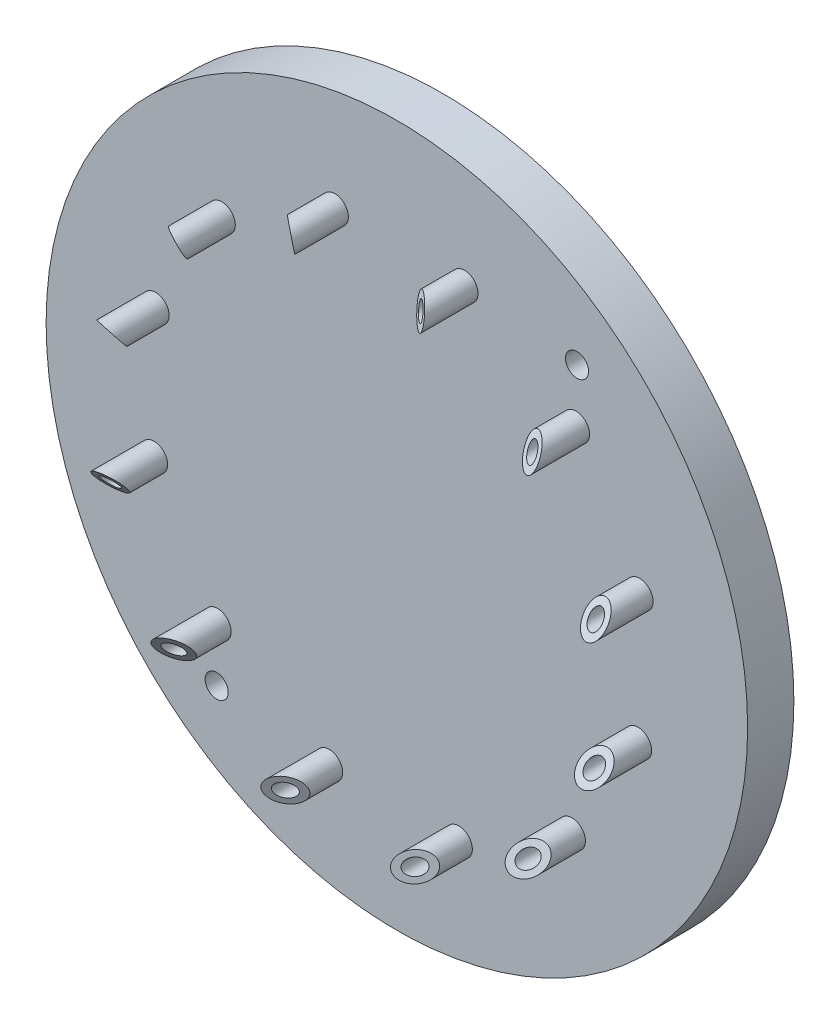
ISO-10303-21;
HEADER;
FILE_DESCRIPTION(('STEP AP214'),'2;1');
FILE_NAME('part.step','',(''),(''),'','','');
FILE_SCHEMA(('AUTOMOTIVE_DESIGN { 1 0 10303 214 1 1 1 1 }'));
ENDSEC;
DATA;
#1=APPLICATION_CONTEXT('core data for automotive mechanical design processes');
#2=APPLICATION_PROTOCOL_DEFINITION('international standard','automotive_design',2000,#1);
#3=PRODUCT_CONTEXT('',#1,'mechanical');
#4=PRODUCT('Part','Part','',(#3));
#5=PRODUCT_RELATED_PRODUCT_CATEGORY('part','',(#4));
#6=PRODUCT_DEFINITION_FORMATION('','',#4);
#7=PRODUCT_DEFINITION_CONTEXT('part definition',#1,'design');
#8=PRODUCT_DEFINITION('design','',#6,#7);
#9=PRODUCT_DEFINITION_SHAPE('','',#8);
#10=(LENGTH_UNIT() NAMED_UNIT(*) SI_UNIT(.MILLI.,.METRE.));
#11=(NAMED_UNIT(*) PLANE_ANGLE_UNIT() SI_UNIT($,.RADIAN.));
#12=(NAMED_UNIT(*) SI_UNIT($,.STERADIAN.) SOLID_ANGLE_UNIT());
#13=UNCERTAINTY_MEASURE_WITH_UNIT(LENGTH_MEASURE(1.E-05),#10,'distance_accuracy_value','');
#14=(GEOMETRIC_REPRESENTATION_CONTEXT(3) GLOBAL_UNCERTAINTY_ASSIGNED_CONTEXT((#13)) GLOBAL_UNIT_ASSIGNED_CONTEXT((#10,
#11,#12)) REPRESENTATION_CONTEXT('',''));
#15=CARTESIAN_POINT('',(0.,0.,0.));
#16=DIRECTION('',(0.,0.,1.));
#17=DIRECTION('',(1.,0.,0.));
#18=AXIS2_PLACEMENT_3D('',#15,#16,#17);
#19=CARTESIAN_POINT('',(-8.04204790409298,31.4892912830421,13.1510056260954));
#20=DIRECTION('',(0.,0.,-1.));
#21=DIRECTION('',(-1.,0.,0.));
#22=AXIS2_PLACEMENT_3D('',#19,#20,#21);
#23=CYLINDRICAL_SURFACE('',#22,1.75000000000003);
#24=CARTESIAN_POINT('',(-8.04204790409298,31.4892912830421,6.));
#25=DIRECTION('',(0.,0.,-1.));
#26=DIRECTION('',(-1.,0.,0.));
#27=AXIS2_PLACEMENT_3D('',#24,#25,#26);
#28=CIRCLE('',#27,1.75000000000003);
#29=CARTESIAN_POINT('',(-9.79204790409301,31.4892912830421,6.));
#30=VERTEX_POINT('',#29);
#31=EDGE_CURVE('E19',#30,#30,#28,.T.);
#32=ORIENTED_EDGE('',*,*,#31,.F.);
#33=EDGE_LOOP('',(#32));
#34=FACE_BOUND('',#33,.T.);
#35=CARTESIAN_POINT('',(-8.04204790409298,31.4892912830421,11.6844891227726));
#36=DIRECTION('',(-0.622322508349962,-0.158934901994472,0.766455734226719));
#37=DIRECTION('',(-0.742619934480711,-0.189657653262092,-0.642297133319915));
#38=AXIS2_PLACEMENT_3D('',#35,#36,#37);
#39=ELLIPSE('',#38,2.28323688094735,1.75000000000003);
#40=CARTESIAN_POINT('',(-9.73762512702605,31.0562579343602,10.2179726194498));
#41=VERTEX_POINT('',#40);
#42=EDGE_CURVE('E153',#41,#41,#39,.T.);
#43=ORIENTED_EDGE('',*,*,#42,.F.);
#44=EDGE_LOOP('',(#43));
#45=FACE_BOUND('',#44,.T.);
#46=ADVANCED_FACE('F15',(#34,#45),#23,.T.);
#47=CARTESIAN_POINT('',(8.78002785812512,31.2915501503289,13.1510056260954));
#48=DIRECTION('',(0.,0.,-1.));
#49=DIRECTION('',(-1.,0.,0.));
#50=AXIS2_PLACEMENT_3D('',#47,#48,#49);
#51=CYLINDRICAL_SURFACE('',#50,1.75000000000004);
#52=CARTESIAN_POINT('',(8.78002785812512,31.2915501503289,6.));
#53=DIRECTION('',(0.,0.,-1.));
#54=DIRECTION('',(-1.,0.,0.));
#55=AXIS2_PLACEMENT_3D('',#52,#53,#54);
#56=CIRCLE('',#55,1.75000000000004);
#57=CARTESIAN_POINT('',(7.03002785812508,31.2915501503289,6.));
#58=VERTEX_POINT('',#57);
#59=EDGE_CURVE('E185',#58,#58,#56,.T.);
#60=ORIENTED_EDGE('',*,*,#59,.F.);
#61=EDGE_LOOP('',(#60));
#62=FACE_BOUND('',#61,.T.);
#63=CARTESIAN_POINT('',(8.78002785812512,31.2915501503289,11.6844891227726));
#64=DIRECTION('',(-0.618414552575162,0.173519591499769,0.766455734226717));
#65=DIRECTION('',(-0.737956555248078,0.20706162149323,-0.642297133319918));
#66=AXIS2_PLACEMENT_3D('',#63,#64,#65);
#67=ELLIPSE('',#66,2.28323688094738,1.75000000000004);
#68=CARTESIAN_POINT('',(7.09509823464583,31.764320881151,10.2179726194498));
#69=VERTEX_POINT('',#68);
#70=EDGE_CURVE('E150',#69,#69,#67,.T.);
#71=ORIENTED_EDGE('',*,*,#70,.F.);
#72=EDGE_LOOP('',(#71));
#73=FACE_BOUND('',#72,.T.);
#74=ADVANCED_FACE('F197',(#62,#73),#51,.T.);
#75=CARTESIAN_POINT('',(23.2495022462359,22.709263424917,13.1510056260954));
#76=DIRECTION('',(0.,0.,-1.));
#77=DIRECTION('',(-1.,0.,0.));
#78=AXIS2_PLACEMENT_3D('',#75,#76,#77);
#79=CYLINDRICAL_SURFACE('',#78,1.75);
#80=CARTESIAN_POINT('',(23.2495022462359,22.709263424917,6.));
#81=DIRECTION('',(0.,0.,-1.));
#82=DIRECTION('',(-1.,0.,0.));
#83=AXIS2_PLACEMENT_3D('',#80,#81,#82);
#84=CIRCLE('',#83,1.75);
#85=CARTESIAN_POINT('',(21.4995022462359,22.709263424917,6.));
#86=VERTEX_POINT('',#85);
#87=EDGE_CURVE('E183',#86,#86,#84,.T.);
#88=ORIENTED_EDGE('',*,*,#87,.F.);
#89=EDGE_LOOP('',(#88));
#90=FACE_BOUND('',#89,.T.);
#91=CARTESIAN_POINT('',(23.2495022462359,22.709263424917,11.6844891227726));
#92=DIRECTION('',(-0.448802916850184,0.459479650580684,0.766455734226719));
#93=DIRECTION('',(-0.535558312987469,0.548298901985984,-0.642297133319915));
#94=AXIS2_PLACEMENT_3D('',#91,#92,#93);
#95=ELLIPSE('',#94,2.28323688094732,1.75);
#96=CARTESIAN_POINT('',(22.026695754125,23.9611596997143,10.2179726194499));
#97=VERTEX_POINT('',#96);
#98=EDGE_CURVE('E147',#97,#97,#95,.T.);
#99=ORIENTED_EDGE('',*,*,#98,.F.);
#100=EDGE_LOOP('',(#99));
#101=FACE_BOUND('',#100,.T.);
#102=ADVANCED_FACE('F337',(#90,#101),#79,.T.);
#103=CARTESIAN_POINT('',(31.4892912830421,8.04204790409298,13.1510056260954));
#104=DIRECTION('',(0.,0.,-1.));
#105=DIRECTION('',(-1.,0.,0.));
#106=AXIS2_PLACEMENT_3D('',#103,#104,#105);
#107=CYLINDRICAL_SURFACE('',#106,1.75000000000003);
#108=CARTESIAN_POINT('',(31.4892912830421,8.04204790409298,6.));
#109=DIRECTION('',(0.,0.,-1.));
#110=DIRECTION('',(-1.,0.,0.));
#111=AXIS2_PLACEMENT_3D('',#108,#109,#110);
#112=CIRCLE('',#111,1.75000000000003);
#113=CARTESIAN_POINT('',(29.7392912830421,8.04204790409298,6.));
#114=VERTEX_POINT('',#113);
#115=EDGE_CURVE('E180',#114,#114,#112,.T.);
#116=ORIENTED_EDGE('',*,*,#115,.F.);
#117=EDGE_LOOP('',(#116));
#118=FACE_BOUND('',#117,.T.);
#119=CARTESIAN_POINT('',(31.4892912830421,8.04204790409298,11.6844891227726));
#120=DIRECTION('',(-0.158934901994472,0.622322508349962,0.766455734226719));
#121=DIRECTION('',(-0.189657653262092,0.742619934480711,-0.642297133319915));
#122=AXIS2_PLACEMENT_3D('',#119,#120,#121);
#123=ELLIPSE('',#122,2.28323688094735,1.75000000000003);
#124=CARTESIAN_POINT('',(31.0562579343602,9.73762512702605,10.2179726194498));
#125=VERTEX_POINT('',#124);
#126=EDGE_CURVE('E144',#125,#125,#123,.T.);
#127=ORIENTED_EDGE('',*,*,#126,.F.);
#128=EDGE_LOOP('',(#127));
#129=FACE_BOUND('',#128,.T.);
#130=ADVANCED_FACE('F339',(#118,#129),#107,.T.);
#131=CARTESIAN_POINT('',(31.2915501503289,-8.78002785812511,13.1510056260954));
#132=DIRECTION('',(0.,0.,-1.));
#133=DIRECTION('',(-1.,0.,0.));
#134=AXIS2_PLACEMENT_3D('',#131,#132,#133);
#135=CYLINDRICAL_SURFACE('',#134,1.75000000000004);
#136=CARTESIAN_POINT('',(31.2915501503289,-8.78002785812511,6.));
#137=DIRECTION('',(0.,0.,-1.));
#138=DIRECTION('',(-1.,0.,0.));
#139=AXIS2_PLACEMENT_3D('',#136,#137,#138);
#140=CIRCLE('',#139,1.75000000000004);
#141=CARTESIAN_POINT('',(29.5415501503289,-8.78002785812511,6.));
#142=VERTEX_POINT('',#141);
#143=EDGE_CURVE('E177',#142,#142,#140,.T.);
#144=ORIENTED_EDGE('',*,*,#143,.F.);
#145=EDGE_LOOP('',(#144));
#146=FACE_BOUND('',#145,.T.);
#147=CARTESIAN_POINT('',(31.2915501503289,-8.78002785812511,11.6844891227726));
#148=DIRECTION('',(0.173519591499772,0.618414552575158,0.76645573422672));
#149=DIRECTION('',(0.207061621493235,0.73795655524808,-0.642297133319915));
#150=AXIS2_PLACEMENT_3D('',#147,#148,#149);
#151=ELLIPSE('',#150,2.28323688094737,1.75000000000004);
#152=CARTESIAN_POINT('',(31.764320881151,-7.09509823464583,10.2179726194498));
#153=VERTEX_POINT('',#152);
#154=EDGE_CURVE('E141',#153,#153,#151,.T.);
#155=ORIENTED_EDGE('',*,*,#154,.F.);
#156=EDGE_LOOP('',(#155));
#157=FACE_BOUND('',#156,.T.);
#158=ADVANCED_FACE('F346',(#146,#157),#135,.T.);
#159=CARTESIAN_POINT('',(22.709263424917,-23.2495022462359,13.1510056260954));
#160=DIRECTION('',(0.,0.,-1.));
#161=DIRECTION('',(-1.,0.,0.));
#162=AXIS2_PLACEMENT_3D('',#159,#160,#161);
#163=CYLINDRICAL_SURFACE('',#162,1.75);
#164=CARTESIAN_POINT('',(22.709263424917,-23.2495022462359,6.));
#165=DIRECTION('',(0.,0.,-1.));
#166=DIRECTION('',(-1.,0.,0.));
#167=AXIS2_PLACEMENT_3D('',#164,#165,#166);
#168=CIRCLE('',#167,1.75);
#169=CARTESIAN_POINT('',(20.959263424917,-23.2495022462359,6.));
#170=VERTEX_POINT('',#169);
#171=EDGE_CURVE('E174',#170,#170,#168,.T.);
#172=ORIENTED_EDGE('',*,*,#171,.F.);
#173=EDGE_LOOP('',(#172));
#174=FACE_BOUND('',#173,.T.);
#175=CARTESIAN_POINT('',(22.709263424917,-23.2495022462359,11.6844891227726));
#176=DIRECTION('',(0.459479650580684,0.448802916850184,0.766455734226719));
#177=DIRECTION('',(0.548298901985984,0.535558312987469,-0.642297133319915));
#178=AXIS2_PLACEMENT_3D('',#175,#176,#177);
#179=ELLIPSE('',#178,2.28323688094732,1.75);
#180=CARTESIAN_POINT('',(23.9611596997143,-22.026695754125,10.2179726194499));
#181=VERTEX_POINT('',#180);
#182=EDGE_CURVE('E138',#181,#181,#179,.T.);
#183=ORIENTED_EDGE('',*,*,#182,.F.);
#184=EDGE_LOOP('',(#183));
#185=FACE_BOUND('',#184,.T.);
#186=ADVANCED_FACE('F355',(#174,#185),#163,.T.);
#187=CARTESIAN_POINT('',(8.04204790409293,-31.4892912830422,13.1510056260953));
#188=DIRECTION('',(0.,0.,-1.));
#189=DIRECTION('',(-1.,0.,0.));
#190=AXIS2_PLACEMENT_3D('',#187,#188,#189);
#191=CYLINDRICAL_SURFACE('',#190,1.74999999999994);
#192=CARTESIAN_POINT('',(8.04204790409293,-31.4892912830422,6.));
#193=DIRECTION('',(0.,0.,-1.));
#194=DIRECTION('',(-1.,0.,0.));
#195=AXIS2_PLACEMENT_3D('',#192,#193,#194);
#196=CIRCLE('',#195,1.74999999999994);
#197=CARTESIAN_POINT('',(6.29204790409299,-31.4892912830422,6.));
#198=VERTEX_POINT('',#197);
#199=EDGE_CURVE('E171',#198,#198,#196,.T.);
#200=ORIENTED_EDGE('',*,*,#199,.F.);
#201=EDGE_LOOP('',(#200));
#202=FACE_BOUND('',#201,.T.);
#203=CARTESIAN_POINT('',(8.04204790409293,-31.4892912830422,11.6844891227727));
#204=DIRECTION('',(0.622322508349963,0.158934901994472,0.766455734226718));
#205=DIRECTION('',(0.74261993448071,0.189657653262092,-0.642297133319916));
#206=AXIS2_PLACEMENT_3D('',#203,#204,#205);
#207=ELLIPSE('',#206,2.28323688094724,1.74999999999994);
#208=CARTESIAN_POINT('',(9.7376251270259,-31.0562579343603,10.21797261945));
#209=VERTEX_POINT('',#208);
#210=EDGE_CURVE('E135',#209,#209,#207,.T.);
#211=ORIENTED_EDGE('',*,*,#210,.F.);
#212=EDGE_LOOP('',(#211));
#213=FACE_BOUND('',#212,.T.);
#214=ADVANCED_FACE('F359',(#202,#213),#191,.T.);
#215=CARTESIAN_POINT('',(-8.78002785812511,-31.2915501503289,13.1510056260954));
#216=DIRECTION('',(0.,0.,-1.));
#217=DIRECTION('',(-1.,0.,0.));
#218=AXIS2_PLACEMENT_3D('',#215,#216,#217);
#219=CYLINDRICAL_SURFACE('',#218,1.75000000000004);
#220=CARTESIAN_POINT('',(-8.78002785812511,-31.2915501503289,6.));
#221=DIRECTION('',(0.,0.,-1.));
#222=DIRECTION('',(-1.,0.,0.));
#223=AXIS2_PLACEMENT_3D('',#220,#221,#222);
#224=CIRCLE('',#223,1.75000000000004);
#225=CARTESIAN_POINT('',(-10.5300278581252,-31.2915501503289,6.));
#226=VERTEX_POINT('',#225);
#227=EDGE_CURVE('E168',#226,#226,#224,.T.);
#228=ORIENTED_EDGE('',*,*,#227,.F.);
#229=EDGE_LOOP('',(#228));
#230=FACE_BOUND('',#229,.T.);
#231=CARTESIAN_POINT('',(-8.78002785812511,-31.2915501503289,11.6844891227726));
#232=DIRECTION('',(0.618414552575158,-0.173519591499772,0.76645573422672));
#233=DIRECTION('',(0.73795655524808,-0.207061621493235,-0.642297133319915));
#234=AXIS2_PLACEMENT_3D('',#231,#232,#233);
#235=ELLIPSE('',#234,2.28323688094737,1.75000000000004);
#236=CARTESIAN_POINT('',(-7.09509823464583,-31.764320881151,10.2179726194498));
#237=VERTEX_POINT('',#236);
#238=EDGE_CURVE('E132',#237,#237,#235,.T.);
#239=ORIENTED_EDGE('',*,*,#238,.F.);
#240=EDGE_LOOP('',(#239));
#241=FACE_BOUND('',#240,.T.);
#242=ADVANCED_FACE('F363',(#230,#241),#219,.T.);
#243=CARTESIAN_POINT('',(-23.2495022462359,-22.709263424917,13.1510056260954));
#244=DIRECTION('',(0.,0.,-1.));
#245=DIRECTION('',(-1.,0.,0.));
#246=AXIS2_PLACEMENT_3D('',#243,#244,#245);
#247=CYLINDRICAL_SURFACE('',#246,1.75);
#248=CARTESIAN_POINT('',(-23.2495022462359,-22.709263424917,6.));
#249=DIRECTION('',(0.,0.,-1.));
#250=DIRECTION('',(-1.,0.,0.));
#251=AXIS2_PLACEMENT_3D('',#248,#249,#250);
#252=CIRCLE('',#251,1.75);
#253=CARTESIAN_POINT('',(-24.9995022462359,-22.709263424917,6.));
#254=VERTEX_POINT('',#253);
#255=EDGE_CURVE('E165',#254,#254,#252,.T.);
#256=ORIENTED_EDGE('',*,*,#255,.F.);
#257=EDGE_LOOP('',(#256));
#258=FACE_BOUND('',#257,.T.);
#259=CARTESIAN_POINT('',(-23.2495022462359,-22.709263424917,11.6844891227726));
#260=DIRECTION('',(0.448802916850184,-0.459479650580684,0.766455734226719));
#261=DIRECTION('',(0.535558312987469,-0.548298901985984,-0.642297133319915));
#262=AXIS2_PLACEMENT_3D('',#259,#260,#261);
#263=ELLIPSE('',#262,2.28323688094732,1.75);
#264=CARTESIAN_POINT('',(-22.026695754125,-23.9611596997143,10.2179726194499));
#265=VERTEX_POINT('',#264);
#266=EDGE_CURVE('E129',#265,#265,#263,.T.);
#267=ORIENTED_EDGE('',*,*,#266,.F.);
#268=EDGE_LOOP('',(#267));
#269=FACE_BOUND('',#268,.T.);
#270=ADVANCED_FACE('F367',(#258,#269),#247,.T.);
#271=CARTESIAN_POINT('',(-31.4892912830421,-8.04204790409299,13.1510056260954));
#272=DIRECTION('',(0.,0.,-1.));
#273=DIRECTION('',(-1.,0.,0.));
#274=AXIS2_PLACEMENT_3D('',#271,#272,#273);
#275=CYLINDRICAL_SURFACE('',#274,1.75000000000003);
#276=CARTESIAN_POINT('',(-31.4892912830421,-8.04204790409299,6.));
#277=DIRECTION('',(0.,0.,-1.));
#278=DIRECTION('',(-1.,0.,0.));
#279=AXIS2_PLACEMENT_3D('',#276,#277,#278);
#280=CIRCLE('',#279,1.75000000000003);
#281=CARTESIAN_POINT('',(-33.2392912830421,-8.04204790409299,6.));
#282=VERTEX_POINT('',#281);
#283=EDGE_CURVE('E162',#282,#282,#280,.T.);
#284=ORIENTED_EDGE('',*,*,#283,.F.);
#285=EDGE_LOOP('',(#284));
#286=FACE_BOUND('',#285,.T.);
#287=CARTESIAN_POINT('',(-31.4892912830421,-8.04204790409299,11.6844891227726));
#288=DIRECTION('',(0.158934901994472,-0.622322508349964,0.766455734226717));
#289=DIRECTION('',(0.189657653262092,-0.742619934480709,-0.642297133319917));
#290=AXIS2_PLACEMENT_3D('',#287,#288,#289);
#291=ELLIPSE('',#290,2.28323688094736,1.75000000000003);
#292=CARTESIAN_POINT('',(-31.0562579343602,-9.73762512702606,10.2179726194498));
#293=VERTEX_POINT('',#292);
#294=EDGE_CURVE('E126',#293,#293,#291,.T.);
#295=ORIENTED_EDGE('',*,*,#294,.F.);
#296=EDGE_LOOP('',(#295));
#297=FACE_BOUND('',#296,.T.);
#298=ADVANCED_FACE('F371',(#286,#297),#275,.T.);
#299=CARTESIAN_POINT('',(-31.2915501503289,8.78002785812511,13.1510056260954));
#300=DIRECTION('',(0.,0.,-1.));
#301=DIRECTION('',(-1.,0.,0.));
#302=AXIS2_PLACEMENT_3D('',#299,#300,#301);
#303=CYLINDRICAL_SURFACE('',#302,1.75000000000004);
#304=CARTESIAN_POINT('',(-31.2915501503289,8.78002785812511,6.));
#305=DIRECTION('',(0.,0.,-1.));
#306=DIRECTION('',(-1.,0.,0.));
#307=AXIS2_PLACEMENT_3D('',#304,#305,#306);
#308=CIRCLE('',#307,1.75000000000004);
#309=CARTESIAN_POINT('',(-33.041550150329,8.78002785812511,6.));
#310=VERTEX_POINT('',#309);
#311=EDGE_CURVE('E159',#310,#310,#308,.T.);
#312=ORIENTED_EDGE('',*,*,#311,.F.);
#313=EDGE_LOOP('',(#312));
#314=FACE_BOUND('',#313,.T.);
#315=CARTESIAN_POINT('',(-31.2915501503289,8.78002785812511,11.6844891227726));
#316=DIRECTION('',(-0.173519591499773,-0.618414552575155,0.766455734226722));
#317=DIRECTION('',(-0.207061621493238,-0.737956555248081,-0.642297133319912));
#318=AXIS2_PLACEMENT_3D('',#315,#316,#317);
#319=ELLIPSE('',#318,2.28323688094736,1.75000000000004);
#320=CARTESIAN_POINT('',(-31.764320881151,7.09509823464582,10.2179726194498));
#321=VERTEX_POINT('',#320);
#322=EDGE_CURVE('E123',#321,#321,#319,.T.);
#323=ORIENTED_EDGE('',*,*,#322,.F.);
#324=EDGE_LOOP('',(#323));
#325=FACE_BOUND('',#324,.T.);
#326=ADVANCED_FACE('F375',(#314,#325),#303,.T.);
#327=CARTESIAN_POINT('',(-22.709263424917,23.2495022462359,13.1510056260954));
#328=DIRECTION('',(0.,0.,-1.));
#329=DIRECTION('',(-1.,0.,0.));
#330=AXIS2_PLACEMENT_3D('',#327,#328,#329);
#331=CYLINDRICAL_SURFACE('',#330,1.75);
#332=CARTESIAN_POINT('',(-22.709263424917,23.2495022462359,6.));
#333=DIRECTION('',(0.,0.,-1.));
#334=DIRECTION('',(-1.,0.,0.));
#335=AXIS2_PLACEMENT_3D('',#332,#333,#334);
#336=CIRCLE('',#335,1.75);
#337=CARTESIAN_POINT('',(-24.459263424917,23.2495022462359,6.));
#338=VERTEX_POINT('',#337);
#339=EDGE_CURVE('E156',#338,#338,#336,.T.);
#340=ORIENTED_EDGE('',*,*,#339,.F.);
#341=EDGE_LOOP('',(#340));
#342=FACE_BOUND('',#341,.T.);
#343=CARTESIAN_POINT('',(-22.709263424917,23.2495022462359,11.6844891227726));
#344=DIRECTION('',(-0.459479650580684,-0.448802916850184,0.766455734226719));
#345=DIRECTION('',(-0.548298901985984,-0.535558312987469,-0.642297133319915));
#346=AXIS2_PLACEMENT_3D('',#343,#344,#345);
#347=ELLIPSE('',#346,2.28323688094732,1.75);
#348=CARTESIAN_POINT('',(-23.9611596997143,22.026695754125,10.2179726194499));
#349=VERTEX_POINT('',#348);
#350=EDGE_CURVE('E120',#349,#349,#347,.T.);
#351=ORIENTED_EDGE('',*,*,#350,.F.);
#352=EDGE_LOOP('',(#351));
#353=FACE_BOUND('',#352,.T.);
#354=ADVANCED_FACE('F214',(#342,#353),#331,.T.);
#355=CARTESIAN_POINT('',(-46.41,-46.41,6.));
#356=DIRECTION('',(0.,0.,1.));
#357=DIRECTION('',(1.,0.,0.));
#358=AXIS2_PLACEMENT_3D('',#355,#356,#357);
#359=PLANE('',#358);
#360=ORIENTED_EDGE('',*,*,#339,.T.);
#361=EDGE_LOOP('',(#360));
#362=FACE_BOUND('',#361,.T.);
#363=ORIENTED_EDGE('',*,*,#311,.T.);
#364=EDGE_LOOP('',(#363));
#365=FACE_BOUND('',#364,.T.);
#366=ORIENTED_EDGE('',*,*,#283,.T.);
#367=EDGE_LOOP('',(#366));
#368=FACE_BOUND('',#367,.T.);
#369=ORIENTED_EDGE('',*,*,#255,.T.);
#370=EDGE_LOOP('',(#369));
#371=FACE_BOUND('',#370,.T.);
#372=ORIENTED_EDGE('',*,*,#227,.T.);
#373=EDGE_LOOP('',(#372));
#374=FACE_BOUND('',#373,.T.);
#375=ORIENTED_EDGE('',*,*,#199,.T.);
#376=EDGE_LOOP('',(#375));
#377=FACE_BOUND('',#376,.T.);
#378=ORIENTED_EDGE('',*,*,#171,.T.);
#379=EDGE_LOOP('',(#378));
#380=FACE_BOUND('',#379,.T.);
#381=ORIENTED_EDGE('',*,*,#143,.T.);
#382=EDGE_LOOP('',(#381));
#383=FACE_BOUND('',#382,.T.);
#384=ORIENTED_EDGE('',*,*,#115,.T.);
#385=EDGE_LOOP('',(#384));
#386=FACE_BOUND('',#385,.T.);
#387=ORIENTED_EDGE('',*,*,#87,.T.);
#388=EDGE_LOOP('',(#387));
#389=FACE_BOUND('',#388,.T.);
#390=ORIENTED_EDGE('',*,*,#59,.T.);
#391=EDGE_LOOP('',(#390));
#392=FACE_BOUND('',#391,.T.);
#393=ORIENTED_EDGE('',*,*,#31,.T.);
#394=EDGE_LOOP('',(#393));
#395=FACE_BOUND('',#394,.T.);
#396=CARTESIAN_POINT('',(-23.3709149745766,-29.709263424917,6.));
#397=DIRECTION('',(0.,0.,-1.));
#398=DIRECTION('',(-1.,0.,0.));
#399=AXIS2_PLACEMENT_3D('',#396,#397,#398);
#400=CIRCLE('',#399,1.5);
#401=CARTESIAN_POINT('',(-24.8709149745766,-29.709263424917,6.));
#402=VERTEX_POINT('',#401);
#403=EDGE_CURVE('E111',#402,#402,#400,.F.);
#404=ORIENTED_EDGE('',*,*,#403,.F.);
#405=EDGE_LOOP('',(#404));
#406=FACE_BOUND('',#405,.T.);
#407=CARTESIAN_POINT('',(23.3709149745766,29.709263424917,6.));
#408=DIRECTION('',(0.,0.,-1.));
#409=DIRECTION('',(-1.,0.,0.));
#410=AXIS2_PLACEMENT_3D('',#407,#408,#409);
#411=CIRCLE('',#410,1.5);
#412=CARTESIAN_POINT('',(21.8709149745766,29.709263424917,6.));
#413=VERTEX_POINT('',#412);
#414=EDGE_CURVE('E114',#413,#413,#411,.F.);
#415=ORIENTED_EDGE('',*,*,#414,.F.);
#416=EDGE_LOOP('',(#415));
#417=FACE_BOUND('',#416,.T.);
#418=CARTESIAN_POINT('',(0.,0.,6.));
#419=DIRECTION('',(0.,0.,-1.));
#420=DIRECTION('',(-1.,0.,0.));
#421=AXIS2_PLACEMENT_3D('',#418,#419,#420);
#422=CIRCLE('',#421,45.5);
#423=CARTESIAN_POINT('',(-45.5,0.,6.));
#424=VERTEX_POINT('',#423);
#425=EDGE_CURVE('E117',#424,#424,#422,.T.);
#426=ORIENTED_EDGE('',*,*,#425,.F.);
#427=EDGE_LOOP('',(#426));
#428=FACE_BOUND('',#427,.T.);
#429=ADVANCED_FACE('F192',(#362,#365,#368,#371,#374,#377,#380,#383,#386,#389,#392,#395,#406,
#417,#428),#359,.T.);
#430=CARTESIAN_POINT('',(-6.78816469681549,33.6518133991158,13.1510056260954));
#431=DIRECTION('',(-0.622322508349962,-0.158934901994472,0.766455734226719));
#432=DIRECTION('',(-0.742619934480713,-0.189657653262083,-0.642297133319915));
#433=AXIS2_PLACEMENT_3D('',#430,#431,#432);
#434=PLANE('',#433);
#435=CARTESIAN_POINT('',(-8.04204790409298,31.4892912830421,11.6844891227726));
#436=DIRECTION('',(-0.622322508349962,-0.158934901994472,0.766455734226719));
#437=DIRECTION('',(-0.74261993448071,-0.189657653262096,-0.642297133319915));
#438=AXIS2_PLACEMENT_3D('',#435,#436,#437);
#439=ELLIPSE('',#438,1.30470678911276,1.);
#440=CARTESIAN_POINT('',(-9.01094917434043,31.2418436552239,10.8464796923025));
#441=VERTEX_POINT('',#440);
#442=EDGE_CURVE('E108',#441,#441,#439,.T.);
#443=ORIENTED_EDGE('',*,*,#442,.F.);
#444=EDGE_LOOP('',(#443));
#445=FACE_BOUND('',#444,.T.);
#446=ORIENTED_EDGE('',*,*,#42,.T.);
#447=EDGE_LOOP('',(#446));
#448=FACE_BOUND('',#447,.T.);
#449=ADVANCED_FACE('F201',(#445,#448),#434,.T.);
#450=CARTESIAN_POINT('',(10.9471836270429,32.5374076354556,13.1510056260954));
#451=DIRECTION('',(-0.618414552575162,0.173519591499769,0.766455734226717));
#452=DIRECTION('',(-0.737956555248077,0.207061621493233,-0.642297133319918));
#453=AXIS2_PLACEMENT_3D('',#450,#451,#452);
#454=PLANE('',#453);
#455=CARTESIAN_POINT('',(8.78002785812517,31.2915501503289,11.6844891227726));
#456=DIRECTION('',(-0.618414552575162,0.173519591499769,0.766455734226717));
#457=DIRECTION('',(-0.737956555248079,0.207061621493227,-0.642297133319918));
#458=AXIS2_PLACEMENT_3D('',#455,#456,#457);
#459=ELLIPSE('',#458,1.30470678911275,0.999999999999997);
#460=CARTESIAN_POINT('',(7.81721093042274,31.5617048536558,10.8464796923025));
#461=VERTEX_POINT('',#460);
#462=EDGE_CURVE('E105',#461,#461,#459,.T.);
#463=ORIENTED_EDGE('',*,*,#462,.F.);
#464=EDGE_LOOP('',(#463));
#465=FACE_BOUND('',#464,.T.);
#466=ORIENTED_EDGE('',*,*,#70,.T.);
#467=EDGE_LOOP('',(#466));
#468=FACE_BOUND('',#467,.T.);
#469=ADVANCED_FACE('F203',(#465,#468),#454,.T.);
#470=CARTESIAN_POINT('',(25.74924293864,22.7046297720728,13.1510056260954));
#471=DIRECTION('',(-0.448802916850184,0.459479650580684,0.766455734226719));
#472=DIRECTION('',(-0.53555831298747,0.548298901985983,-0.642297133319915));
#473=AXIS2_PLACEMENT_3D('',#470,#471,#472);
#474=PLANE('',#473);
#475=CARTESIAN_POINT('',(23.2495022462359,22.709263424917,11.6844891227726));
#476=DIRECTION('',(-0.448802916850184,0.459479650580684,0.766455734226719));
#477=DIRECTION('',(-0.535558312987472,0.548298901985982,-0.642297133319915));
#478=AXIS2_PLACEMENT_3D('',#475,#476,#477);
#479=ELLIPSE('',#478,1.30470678911275,0.999999999999998);
#480=CARTESIAN_POINT('',(22.5507556793154,23.4246327248012,10.8464796923025));
#481=VERTEX_POINT('',#480);
#482=EDGE_CURVE('E102',#481,#481,#479,.T.);
#483=ORIENTED_EDGE('',*,*,#482,.F.);
#484=EDGE_LOOP('',(#483));
#485=FACE_BOUND('',#484,.T.);
#486=ORIENTED_EDGE('',*,*,#98,.T.);
#487=EDGE_LOOP('',(#486));
#488=FACE_BOUND('',#487,.T.);
#489=ADVANCED_FACE('F211',(#485,#488),#474,.T.);
#490=CARTESIAN_POINT('',(33.6518133991158,6.78816469681549,13.1510056260954));
#491=DIRECTION('',(-0.158934901994472,0.622322508349962,0.766455734226719));
#492=DIRECTION('',(-0.189657653262083,0.742619934480713,-0.642297133319915));
#493=AXIS2_PLACEMENT_3D('',#490,#491,#492);
#494=PLANE('',#493);
#495=CARTESIAN_POINT('',(31.4892912830421,8.04204790409298,11.6844891227726));
#496=DIRECTION('',(-0.158934901994472,0.622322508349962,0.766455734226719));
#497=DIRECTION('',(-0.189657653262096,0.74261993448071,-0.642297133319915));
#498=AXIS2_PLACEMENT_3D('',#495,#496,#497);
#499=ELLIPSE('',#498,1.30470678911276,1.);
#500=CARTESIAN_POINT('',(31.2418436552239,9.01094917434043,10.8464796923025));
#501=VERTEX_POINT('',#500);
#502=EDGE_CURVE('E99',#501,#501,#499,.T.);
#503=ORIENTED_EDGE('',*,*,#502,.F.);
#504=EDGE_LOOP('',(#503));
#505=FACE_BOUND('',#504,.T.);
#506=ORIENTED_EDGE('',*,*,#126,.T.);
#507=EDGE_LOOP('',(#506));
#508=FACE_BOUND('',#507,.T.);
#509=ADVANCED_FACE('F324',(#505,#508),#494,.T.);
#510=CARTESIAN_POINT('',(32.5374076354556,-10.9471836270429,13.1510056260954));
#511=DIRECTION('',(0.173519591499772,0.618414552575158,0.76645573422672));
#512=DIRECTION('',(0.207061621493232,0.73795655524808,-0.642297133319915));
#513=AXIS2_PLACEMENT_3D('',#510,#511,#512);
#514=PLANE('',#513);
#515=CARTESIAN_POINT('',(31.2915501503289,-8.78002785812515,11.6844891227726));
#516=DIRECTION('',(0.173519591499772,0.618414552575158,0.76645573422672));
#517=DIRECTION('',(0.207061621493231,0.737956555248081,-0.642297133319915));
#518=AXIS2_PLACEMENT_3D('',#515,#516,#517);
#519=ELLIPSE('',#518,1.30470678911275,0.999999999999997);
#520=CARTESIAN_POINT('',(31.5617048536558,-7.81721093042272,10.8464796923025));
#521=VERTEX_POINT('',#520);
#522=EDGE_CURVE('E96',#521,#521,#519,.T.);
#523=ORIENTED_EDGE('',*,*,#522,.F.);
#524=EDGE_LOOP('',(#523));
#525=FACE_BOUND('',#524,.T.);
#526=ORIENTED_EDGE('',*,*,#154,.T.);
#527=EDGE_LOOP('',(#526));
#528=FACE_BOUND('',#527,.T.);
#529=ADVANCED_FACE('F320',(#525,#528),#514,.T.);
#530=CARTESIAN_POINT('',(22.7046297720728,-25.74924293864,13.1510056260954));
#531=DIRECTION('',(0.459479650580684,0.448802916850184,0.766455734226719));
#532=DIRECTION('',(0.548298901985983,0.53555831298747,-0.642297133319915));
#533=AXIS2_PLACEMENT_3D('',#530,#531,#532);
#534=PLANE('',#533);
#535=CARTESIAN_POINT('',(22.709263424917,-23.2495022462359,11.6844891227726));
#536=DIRECTION('',(0.459479650580684,0.448802916850184,0.766455734226719));
#537=DIRECTION('',(0.548298901985982,0.535558312987472,-0.642297133319915));
#538=AXIS2_PLACEMENT_3D('',#535,#536,#537);
#539=ELLIPSE('',#538,1.30470678911275,0.999999999999998);
#540=CARTESIAN_POINT('',(23.4246327248012,-22.5507556793154,10.8464796923025));
#541=VERTEX_POINT('',#540);
#542=EDGE_CURVE('E93',#541,#541,#539,.T.);
#543=ORIENTED_EDGE('',*,*,#542,.F.);
#544=EDGE_LOOP('',(#543));
#545=FACE_BOUND('',#544,.T.);
#546=ORIENTED_EDGE('',*,*,#182,.T.);
#547=EDGE_LOOP('',(#546));
#548=FACE_BOUND('',#547,.T.);
#549=ADVANCED_FACE('F316',(#545,#548),#534,.T.);
#550=CARTESIAN_POINT('',(6.7881646968155,-33.6518133991158,13.1510056260954));
#551=DIRECTION('',(0.622322508349963,0.158934901994472,0.766455734226718));
#552=DIRECTION('',(0.742619934480712,0.189657653262084,-0.642297133319916));
#553=AXIS2_PLACEMENT_3D('',#550,#551,#552);
#554=PLANE('',#553);
#555=CARTESIAN_POINT('',(8.04204790409296,-31.4892912830422,11.6844891227726));
#556=DIRECTION('',(0.622322508349963,0.158934901994472,0.766455734226718));
#557=DIRECTION('',(0.742619934480709,0.189657653262096,-0.642297133319916));
#558=AXIS2_PLACEMENT_3D('',#555,#556,#557);
#559=ELLIPSE('',#558,1.30470678911275,0.999999999999994);
#560=CARTESIAN_POINT('',(9.0109491743404,-31.2418436552239,10.8464796923025));
#561=VERTEX_POINT('',#560);
#562=EDGE_CURVE('E90',#561,#561,#559,.T.);
#563=ORIENTED_EDGE('',*,*,#562,.F.);
#564=EDGE_LOOP('',(#563));
#565=FACE_BOUND('',#564,.T.);
#566=ORIENTED_EDGE('',*,*,#210,.T.);
#567=EDGE_LOOP('',(#566));
#568=FACE_BOUND('',#567,.T.);
#569=ADVANCED_FACE('F312',(#565,#568),#554,.T.);
#570=CARTESIAN_POINT('',(-10.9471836270429,-32.5374076354556,13.1510056260954));
#571=DIRECTION('',(0.618414552575158,-0.173519591499772,0.76645573422672));
#572=DIRECTION('',(0.73795655524808,-0.207061621493232,-0.642297133319915));
#573=AXIS2_PLACEMENT_3D('',#570,#571,#572);
#574=PLANE('',#573);
#575=CARTESIAN_POINT('',(-8.78002785812515,-31.2915501503289,11.6844891227726));
#576=DIRECTION('',(0.618414552575158,-0.173519591499772,0.76645573422672));
#577=DIRECTION('',(0.737956555248081,-0.207061621493231,-0.642297133319915));
#578=AXIS2_PLACEMENT_3D('',#575,#576,#577);
#579=ELLIPSE('',#578,1.30470678911275,0.999999999999997);
#580=CARTESIAN_POINT('',(-7.81721093042272,-31.5617048536558,10.8464796923025));
#581=VERTEX_POINT('',#580);
#582=EDGE_CURVE('E87',#581,#581,#579,.T.);
#583=ORIENTED_EDGE('',*,*,#582,.F.);
#584=EDGE_LOOP('',(#583));
#585=FACE_BOUND('',#584,.T.);
#586=ORIENTED_EDGE('',*,*,#238,.T.);
#587=EDGE_LOOP('',(#586));
#588=FACE_BOUND('',#587,.T.);
#589=ADVANCED_FACE('F308',(#585,#588),#574,.T.);
#590=CARTESIAN_POINT('',(-25.74924293864,-22.7046297720728,13.1510056260954));
#591=DIRECTION('',(0.448802916850184,-0.459479650580684,0.766455734226719));
#592=DIRECTION('',(0.53555831298747,-0.548298901985983,-0.642297133319915));
#593=AXIS2_PLACEMENT_3D('',#590,#591,#592);
#594=PLANE('',#593);
#595=CARTESIAN_POINT('',(-23.2495022462359,-22.709263424917,11.6844891227726));
#596=DIRECTION('',(0.448802916850184,-0.459479650580684,0.766455734226719));
#597=DIRECTION('',(0.535558312987472,-0.548298901985982,-0.642297133319915));
#598=AXIS2_PLACEMENT_3D('',#595,#596,#597);
#599=ELLIPSE('',#598,1.30470678911275,0.999999999999998);
#600=CARTESIAN_POINT('',(-22.5507556793154,-23.4246327248012,10.8464796923025));
#601=VERTEX_POINT('',#600);
#602=EDGE_CURVE('E84',#601,#601,#599,.T.);
#603=ORIENTED_EDGE('',*,*,#602,.F.);
#604=EDGE_LOOP('',(#603));
#605=FACE_BOUND('',#604,.T.);
#606=ORIENTED_EDGE('',*,*,#266,.T.);
#607=EDGE_LOOP('',(#606));
#608=FACE_BOUND('',#607,.T.);
#609=ADVANCED_FACE('F304',(#605,#608),#594,.T.);
#610=CARTESIAN_POINT('',(-33.6518133991158,-6.78816469681551,13.1510056260954));
#611=DIRECTION('',(0.158934901994472,-0.622322508349964,0.766455734226717));
#612=DIRECTION('',(0.189657653262084,-0.742619934480711,-0.642297133319917));
#613=AXIS2_PLACEMENT_3D('',#610,#611,#612);
#614=PLANE('',#613);
#615=CARTESIAN_POINT('',(-31.4892912830421,-8.04204790409299,11.6844891227726));
#616=DIRECTION('',(0.158934901994472,-0.622322508349964,0.766455734226717));
#617=DIRECTION('',(0.189657653262096,-0.742619934480708,-0.642297133319917));
#618=AXIS2_PLACEMENT_3D('',#615,#616,#617);
#619=ELLIPSE('',#618,1.30470678911276,1.);
#620=CARTESIAN_POINT('',(-31.2418436552239,-9.01094917434044,10.8464796923025));
#621=VERTEX_POINT('',#620);
#622=EDGE_CURVE('E81',#621,#621,#619,.T.);
#623=ORIENTED_EDGE('',*,*,#622,.F.);
#624=EDGE_LOOP('',(#623));
#625=FACE_BOUND('',#624,.T.);
#626=ORIENTED_EDGE('',*,*,#294,.T.);
#627=EDGE_LOOP('',(#626));
#628=FACE_BOUND('',#627,.T.);
#629=ADVANCED_FACE('F300',(#625,#628),#614,.T.);
#630=CARTESIAN_POINT('',(-32.5374076354556,10.9471836270429,13.1510056260954));
#631=DIRECTION('',(-0.173519591499773,-0.618414552575155,0.766455734226722));
#632=DIRECTION('',(-0.207061621493254,-0.737956555248077,-0.642297133319912));
#633=AXIS2_PLACEMENT_3D('',#630,#631,#632);
#634=PLANE('',#633);
#635=CARTESIAN_POINT('',(-31.2915501503289,8.78002785812514,11.6844891227726));
#636=DIRECTION('',(-0.173519591499773,-0.618414552575155,0.766455734226722));
#637=DIRECTION('',(-0.207061621493234,-0.737956555248082,-0.642297133319912));
#638=AXIS2_PLACEMENT_3D('',#635,#636,#637);
#639=ELLIPSE('',#638,1.30470678911274,0.999999999999996);
#640=CARTESIAN_POINT('',(-31.5617048536558,7.81721093042271,10.8464796923025));
#641=VERTEX_POINT('',#640);
#642=EDGE_CURVE('E78',#641,#641,#639,.T.);
#643=ORIENTED_EDGE('',*,*,#642,.F.);
#644=EDGE_LOOP('',(#643));
#645=FACE_BOUND('',#644,.T.);
#646=ORIENTED_EDGE('',*,*,#322,.T.);
#647=EDGE_LOOP('',(#646));
#648=FACE_BOUND('',#647,.T.);
#649=ADVANCED_FACE('F296',(#645,#648),#634,.T.);
#650=CARTESIAN_POINT('',(-22.7046297720728,25.74924293864,13.1510056260954));
#651=DIRECTION('',(-0.459479650580684,-0.448802916850184,0.766455734226719));
#652=DIRECTION('',(-0.548298901985983,-0.53555831298747,-0.642297133319915));
#653=AXIS2_PLACEMENT_3D('',#650,#651,#652);
#654=PLANE('',#653);
#655=CARTESIAN_POINT('',(-22.709263424917,23.2495022462359,11.6844891227726));
#656=DIRECTION('',(-0.459479650580684,-0.448802916850184,0.766455734226719));
#657=DIRECTION('',(-0.548298901985982,-0.535558312987472,-0.642297133319915));
#658=AXIS2_PLACEMENT_3D('',#655,#656,#657);
#659=ELLIPSE('',#658,1.30470678911275,0.999999999999998);
#660=CARTESIAN_POINT('',(-23.4246327248012,22.5507556793154,10.8464796923025));
#661=VERTEX_POINT('',#660);
#662=EDGE_CURVE('E75',#661,#661,#659,.T.);
#663=ORIENTED_EDGE('',*,*,#662,.F.);
#664=EDGE_LOOP('',(#663));
#665=FACE_BOUND('',#664,.T.);
#666=ORIENTED_EDGE('',*,*,#350,.T.);
#667=EDGE_LOOP('',(#666));
#668=FACE_BOUND('',#667,.T.);
#669=ADVANCED_FACE('F292',(#665,#668),#654,.T.);
#670=CARTESIAN_POINT('',(0.,0.,6.));
#671=DIRECTION('',(0.,0.,-1.));
#672=DIRECTION('',(-1.,0.,0.));
#673=AXIS2_PLACEMENT_3D('',#670,#671,#672);
#674=CYLINDRICAL_SURFACE('',#673,45.5);
#675=CARTESIAN_POINT('',(0.,0.,0.));
#676=DIRECTION('',(0.,0.,-1.));
#677=DIRECTION('',(-1.,0.,0.));
#678=AXIS2_PLACEMENT_3D('',#675,#676,#677);
#679=CIRCLE('',#678,45.5);
#680=CARTESIAN_POINT('',(-45.5,0.,0.));
#681=VERTEX_POINT('',#680);
#682=EDGE_CURVE('E72',#681,#681,#679,.T.);
#683=ORIENTED_EDGE('',*,*,#682,.F.);
#684=EDGE_LOOP('',(#683));
#685=FACE_BOUND('',#684,.T.);
#686=ORIENTED_EDGE('',*,*,#425,.T.);
#687=EDGE_LOOP('',(#686));
#688=FACE_BOUND('',#687,.T.);
#689=ADVANCED_FACE('F288',(#685,#688),#674,.T.);
#690=CARTESIAN_POINT('',(23.3709149745766,29.709263424917,6.));
#691=DIRECTION('',(0.,0.,-1.));
#692=DIRECTION('',(-1.,0.,0.));
#693=AXIS2_PLACEMENT_3D('',#690,#691,#692);
#694=CYLINDRICAL_SURFACE('',#693,1.5);
#695=CARTESIAN_POINT('',(23.3709149745766,29.709263424917,0.));
#696=DIRECTION('',(0.,0.,-1.));
#697=DIRECTION('',(-1.,0.,0.));
#698=AXIS2_PLACEMENT_3D('',#695,#696,#697);
#699=CIRCLE('',#698,1.5);
#700=CARTESIAN_POINT('',(21.8709149745766,29.709263424917,0.));
#701=VERTEX_POINT('',#700);
#702=EDGE_CURVE('E69',#701,#701,#699,.F.);
#703=ORIENTED_EDGE('',*,*,#702,.F.);
#704=EDGE_LOOP('',(#703));
#705=FACE_BOUND('',#704,.T.);
#706=ORIENTED_EDGE('',*,*,#414,.T.);
#707=EDGE_LOOP('',(#706));
#708=FACE_BOUND('',#707,.T.);
#709=ADVANCED_FACE('F284',(#705,#708),#694,.F.);
#710=CARTESIAN_POINT('',(-23.3709149745766,-29.709263424917,6.));
#711=DIRECTION('',(0.,0.,-1.));
#712=DIRECTION('',(-1.,0.,0.));
#713=AXIS2_PLACEMENT_3D('',#710,#711,#712);
#714=CYLINDRICAL_SURFACE('',#713,1.5);
#715=CARTESIAN_POINT('',(-23.3709149745766,-29.709263424917,0.));
#716=DIRECTION('',(0.,0.,-1.));
#717=DIRECTION('',(-1.,0.,0.));
#718=AXIS2_PLACEMENT_3D('',#715,#716,#717);
#719=CIRCLE('',#718,1.5);
#720=CARTESIAN_POINT('',(-24.8709149745766,-29.709263424917,0.));
#721=VERTEX_POINT('',#720);
#722=EDGE_CURVE('E66',#721,#721,#719,.F.);
#723=ORIENTED_EDGE('',*,*,#722,.F.);
#724=EDGE_LOOP('',(#723));
#725=FACE_BOUND('',#724,.T.);
#726=ORIENTED_EDGE('',*,*,#403,.T.);
#727=EDGE_LOOP('',(#726));
#728=FACE_BOUND('',#727,.T.);
#729=ADVANCED_FACE('F280',(#725,#728),#714,.F.);
#730=CARTESIAN_POINT('',(-8.04204790409298,31.4892912830421,12.5224985532428));
#731=DIRECTION('',(0.,0.,-1.));
#732=DIRECTION('',(0.,1.,0.));
#733=AXIS2_PLACEMENT_3D('',#730,#731,#732);
#734=CYLINDRICAL_SURFACE('',#733,1.);
#735=CARTESIAN_POINT('',(-8.04204790409297,31.4892912830421,0.));
#736=DIRECTION('',(0.,0.,-1.));
#737=DIRECTION('',(0.,1.,0.));
#738=AXIS2_PLACEMENT_3D('',#735,#736,#737);
#739=CIRCLE('',#738,1.);
#740=CARTESIAN_POINT('',(-8.04204790409297,32.4892912830421,0.));
#741=VERTEX_POINT('',#740);
#742=EDGE_CURVE('E63',#741,#741,#739,.F.);
#743=ORIENTED_EDGE('',*,*,#742,.F.);
#744=EDGE_LOOP('',(#743));
#745=FACE_BOUND('',#744,.T.);
#746=ORIENTED_EDGE('',*,*,#442,.T.);
#747=EDGE_LOOP('',(#746));
#748=FACE_BOUND('',#747,.T.);
#749=ADVANCED_FACE('F276',(#745,#748),#734,.F.);
#750=CARTESIAN_POINT('',(8.78002785812517,31.2915501503289,12.5224985532428));
#751=DIRECTION('',(0.,0.,-1.));
#752=DIRECTION('',(0.,1.,0.));
#753=AXIS2_PLACEMENT_3D('',#750,#751,#752);
#754=CYLINDRICAL_SURFACE('',#753,0.999999999999997);
#755=CARTESIAN_POINT('',(8.78002785812516,31.2915501503288,0.));
#756=DIRECTION('',(0.,0.,-1.));
#757=DIRECTION('',(0.,1.,0.));
#758=AXIS2_PLACEMENT_3D('',#755,#756,#757);
#759=CIRCLE('',#758,0.999999999999997);
#760=CARTESIAN_POINT('',(8.78002785812516,32.2915501503288,0.));
#761=VERTEX_POINT('',#760);
#762=EDGE_CURVE('E60',#761,#761,#759,.F.);
#763=ORIENTED_EDGE('',*,*,#762,.F.);
#764=EDGE_LOOP('',(#763));
#765=FACE_BOUND('',#764,.T.);
#766=ORIENTED_EDGE('',*,*,#462,.T.);
#767=EDGE_LOOP('',(#766));
#768=FACE_BOUND('',#767,.T.);
#769=ADVANCED_FACE('F272',(#765,#768),#754,.F.);
#770=CARTESIAN_POINT('',(23.2495022462359,22.709263424917,12.5224985532428));
#771=DIRECTION('',(0.,0.,-1.));
#772=DIRECTION('',(-1.,0.,0.));
#773=AXIS2_PLACEMENT_3D('',#770,#771,#772);
#774=CYLINDRICAL_SURFACE('',#773,0.999999999999998);
#775=CARTESIAN_POINT('',(23.2495022462359,22.709263424917,0.));
#776=DIRECTION('',(0.,0.,-1.));
#777=DIRECTION('',(-1.,0.,0.));
#778=AXIS2_PLACEMENT_3D('',#775,#776,#777);
#779=CIRCLE('',#778,0.999999999999998);
#780=CARTESIAN_POINT('',(22.2495022462359,22.709263424917,0.));
#781=VERTEX_POINT('',#780);
#782=EDGE_CURVE('E57',#781,#781,#779,.F.);
#783=ORIENTED_EDGE('',*,*,#782,.F.);
#784=EDGE_LOOP('',(#783));
#785=FACE_BOUND('',#784,.T.);
#786=ORIENTED_EDGE('',*,*,#482,.T.);
#787=EDGE_LOOP('',(#786));
#788=FACE_BOUND('',#787,.T.);
#789=ADVANCED_FACE('F268',(#785,#788),#774,.F.);
#790=CARTESIAN_POINT('',(31.4892912830421,8.04204790409298,12.5224985532428));
#791=DIRECTION('',(0.,0.,-1.));
#792=DIRECTION('',(-1.,0.,0.));
#793=AXIS2_PLACEMENT_3D('',#790,#791,#792);
#794=CYLINDRICAL_SURFACE('',#793,1.);
#795=CARTESIAN_POINT('',(31.4892912830421,8.04204790409297,0.));
#796=DIRECTION('',(0.,0.,-1.));
#797=DIRECTION('',(-1.,0.,0.));
#798=AXIS2_PLACEMENT_3D('',#795,#796,#797);
#799=CIRCLE('',#798,1.);
#800=CARTESIAN_POINT('',(30.4892912830421,8.04204790409297,0.));
#801=VERTEX_POINT('',#800);
#802=EDGE_CURVE('E54',#801,#801,#799,.F.);
#803=ORIENTED_EDGE('',*,*,#802,.F.);
#804=EDGE_LOOP('',(#803));
#805=FACE_BOUND('',#804,.T.);
#806=ORIENTED_EDGE('',*,*,#502,.T.);
#807=EDGE_LOOP('',(#806));
#808=FACE_BOUND('',#807,.T.);
#809=ADVANCED_FACE('F264',(#805,#808),#794,.F.);
#810=CARTESIAN_POINT('',(31.2915501503289,-8.78002785812515,12.5224985532428));
#811=DIRECTION('',(0.,0.,-1.));
#812=DIRECTION('',(-1.,0.,0.));
#813=AXIS2_PLACEMENT_3D('',#810,#811,#812);
#814=CYLINDRICAL_SURFACE('',#813,0.999999999999997);
#815=CARTESIAN_POINT('',(31.2915501503288,-8.78002785812514,0.));
#816=DIRECTION('',(0.,0.,-1.));
#817=DIRECTION('',(-1.,0.,0.));
#818=AXIS2_PLACEMENT_3D('',#815,#816,#817);
#819=CIRCLE('',#818,0.999999999999997);
#820=CARTESIAN_POINT('',(30.2915501503288,-8.78002785812514,0.));
#821=VERTEX_POINT('',#820);
#822=EDGE_CURVE('E51',#821,#821,#819,.F.);
#823=ORIENTED_EDGE('',*,*,#822,.F.);
#824=EDGE_LOOP('',(#823));
#825=FACE_BOUND('',#824,.T.);
#826=ORIENTED_EDGE('',*,*,#522,.T.);
#827=EDGE_LOOP('',(#826));
#828=FACE_BOUND('',#827,.T.);
#829=ADVANCED_FACE('F260',(#825,#828),#814,.F.);
#830=CARTESIAN_POINT('',(22.709263424917,-23.2495022462359,12.5224985532428));
#831=DIRECTION('',(0.,0.,-1.));
#832=DIRECTION('',(0.,1.,0.));
#833=AXIS2_PLACEMENT_3D('',#830,#831,#832);
#834=CYLINDRICAL_SURFACE('',#833,0.999999999999998);
#835=CARTESIAN_POINT('',(22.709263424917,-23.2495022462359,0.));
#836=DIRECTION('',(0.,0.,-1.));
#837=DIRECTION('',(0.,1.,0.));
#838=AXIS2_PLACEMENT_3D('',#835,#836,#837);
#839=CIRCLE('',#838,0.999999999999998);
#840=CARTESIAN_POINT('',(22.709263424917,-22.2495022462359,0.));
#841=VERTEX_POINT('',#840);
#842=EDGE_CURVE('E48',#841,#841,#839,.F.);
#843=ORIENTED_EDGE('',*,*,#842,.F.);
#844=EDGE_LOOP('',(#843));
#845=FACE_BOUND('',#844,.T.);
#846=ORIENTED_EDGE('',*,*,#542,.T.);
#847=EDGE_LOOP('',(#846));
#848=FACE_BOUND('',#847,.T.);
#849=ADVANCED_FACE('F256',(#845,#848),#834,.F.);
#850=CARTESIAN_POINT('',(8.04204790409296,-31.4892912830422,12.5224985532428));
#851=DIRECTION('',(0.,0.,-1.));
#852=DIRECTION('',(0.,1.,0.));
#853=AXIS2_PLACEMENT_3D('',#850,#851,#852);
#854=CYLINDRICAL_SURFACE('',#853,0.999999999999994);
#855=CARTESIAN_POINT('',(8.04204790409295,-31.4892912830421,0.));
#856=DIRECTION('',(0.,0.,-1.));
#857=DIRECTION('',(0.,1.,0.));
#858=AXIS2_PLACEMENT_3D('',#855,#856,#857);
#859=CIRCLE('',#858,0.999999999999994);
#860=CARTESIAN_POINT('',(8.04204790409295,-30.4892912830421,0.));
#861=VERTEX_POINT('',#860);
#862=EDGE_CURVE('E45',#861,#861,#859,.F.);
#863=ORIENTED_EDGE('',*,*,#862,.F.);
#864=EDGE_LOOP('',(#863));
#865=FACE_BOUND('',#864,.T.);
#866=ORIENTED_EDGE('',*,*,#562,.T.);
#867=EDGE_LOOP('',(#866));
#868=FACE_BOUND('',#867,.T.);
#869=ADVANCED_FACE('F252',(#865,#868),#854,.F.);
#870=CARTESIAN_POINT('',(-8.78002785812515,-31.2915501503289,12.5224985532428));
#871=DIRECTION('',(0.,0.,-1.));
#872=DIRECTION('',(0.,1.,0.));
#873=AXIS2_PLACEMENT_3D('',#870,#871,#872);
#874=CYLINDRICAL_SURFACE('',#873,0.999999999999997);
#875=CARTESIAN_POINT('',(-8.78002785812514,-31.2915501503288,0.));
#876=DIRECTION('',(0.,0.,-1.));
#877=DIRECTION('',(0.,1.,0.));
#878=AXIS2_PLACEMENT_3D('',#875,#876,#877);
#879=CIRCLE('',#878,0.999999999999997);
#880=CARTESIAN_POINT('',(-8.78002785812514,-30.2915501503288,0.));
#881=VERTEX_POINT('',#880);
#882=EDGE_CURVE('E42',#881,#881,#879,.F.);
#883=ORIENTED_EDGE('',*,*,#882,.F.);
#884=EDGE_LOOP('',(#883));
#885=FACE_BOUND('',#884,.T.);
#886=ORIENTED_EDGE('',*,*,#582,.T.);
#887=EDGE_LOOP('',(#886));
#888=FACE_BOUND('',#887,.T.);
#889=ADVANCED_FACE('F248',(#885,#888),#874,.F.);
#890=CARTESIAN_POINT('',(-23.2495022462359,-22.709263424917,12.5224985532428));
#891=DIRECTION('',(0.,0.,-1.));
#892=DIRECTION('',(-1.,0.,0.));
#893=AXIS2_PLACEMENT_3D('',#890,#891,#892);
#894=CYLINDRICAL_SURFACE('',#893,0.999999999999998);
#895=CARTESIAN_POINT('',(-23.2495022462359,-22.709263424917,0.));
#896=DIRECTION('',(0.,0.,-1.));
#897=DIRECTION('',(-1.,0.,0.));
#898=AXIS2_PLACEMENT_3D('',#895,#896,#897);
#899=CIRCLE('',#898,0.999999999999998);
#900=CARTESIAN_POINT('',(-24.2495022462359,-22.709263424917,0.));
#901=VERTEX_POINT('',#900);
#902=EDGE_CURVE('E39',#901,#901,#899,.F.);
#903=ORIENTED_EDGE('',*,*,#902,.F.);
#904=EDGE_LOOP('',(#903));
#905=FACE_BOUND('',#904,.T.);
#906=ORIENTED_EDGE('',*,*,#602,.T.);
#907=EDGE_LOOP('',(#906));
#908=FACE_BOUND('',#907,.T.);
#909=ADVANCED_FACE('F244',(#905,#908),#894,.F.);
#910=CARTESIAN_POINT('',(-31.4892912830421,-8.04204790409299,12.5224985532428));
#911=DIRECTION('',(0.,0.,-1.));
#912=DIRECTION('',(-1.,0.,0.));
#913=AXIS2_PLACEMENT_3D('',#910,#911,#912);
#914=CYLINDRICAL_SURFACE('',#913,1.);
#915=CARTESIAN_POINT('',(-31.4892912830421,-8.04204790409298,0.));
#916=DIRECTION('',(0.,0.,-1.));
#917=DIRECTION('',(-1.,0.,0.));
#918=AXIS2_PLACEMENT_3D('',#915,#916,#917);
#919=CIRCLE('',#918,1.);
#920=CARTESIAN_POINT('',(-32.4892912830421,-8.04204790409298,0.));
#921=VERTEX_POINT('',#920);
#922=EDGE_CURVE('E36',#921,#921,#919,.F.);
#923=ORIENTED_EDGE('',*,*,#922,.F.);
#924=EDGE_LOOP('',(#923));
#925=FACE_BOUND('',#924,.T.);
#926=ORIENTED_EDGE('',*,*,#622,.T.);
#927=EDGE_LOOP('',(#926));
#928=FACE_BOUND('',#927,.T.);
#929=ADVANCED_FACE('F240',(#925,#928),#914,.F.);
#930=CARTESIAN_POINT('',(-31.2915501503289,8.78002785812514,12.5224985532428));
#931=DIRECTION('',(0.,0.,-1.));
#932=DIRECTION('',(-1.,0.,0.));
#933=AXIS2_PLACEMENT_3D('',#930,#931,#932);
#934=CYLINDRICAL_SURFACE('',#933,0.999999999999996);
#935=CARTESIAN_POINT('',(-31.2915501503288,8.78002785812513,0.));
#936=DIRECTION('',(0.,0.,-1.));
#937=DIRECTION('',(-1.,0.,0.));
#938=AXIS2_PLACEMENT_3D('',#935,#936,#937);
#939=CIRCLE('',#938,0.999999999999996);
#940=CARTESIAN_POINT('',(-32.2915501503288,8.78002785812513,0.));
#941=VERTEX_POINT('',#940);
#942=EDGE_CURVE('E33',#941,#941,#939,.F.);
#943=ORIENTED_EDGE('',*,*,#942,.F.);
#944=EDGE_LOOP('',(#943));
#945=FACE_BOUND('',#944,.T.);
#946=ORIENTED_EDGE('',*,*,#642,.T.);
#947=EDGE_LOOP('',(#946));
#948=FACE_BOUND('',#947,.T.);
#949=ADVANCED_FACE('F234',(#945,#948),#934,.F.);
#950=CARTESIAN_POINT('',(-22.709263424917,23.2495022462359,12.5224985532428));
#951=DIRECTION('',(0.,0.,-1.));
#952=DIRECTION('',(0.,1.,0.));
#953=AXIS2_PLACEMENT_3D('',#950,#951,#952);
#954=CYLINDRICAL_SURFACE('',#953,0.999999999999998);
#955=CARTESIAN_POINT('',(-22.709263424917,23.2495022462359,0.));
#956=DIRECTION('',(0.,0.,-1.));
#957=DIRECTION('',(0.,1.,0.));
#958=AXIS2_PLACEMENT_3D('',#955,#956,#957);
#959=CIRCLE('',#958,0.999999999999998);
#960=CARTESIAN_POINT('',(-22.709263424917,24.2495022462359,0.));
#961=VERTEX_POINT('',#960);
#962=EDGE_CURVE('E28',#961,#961,#959,.F.);
#963=ORIENTED_EDGE('',*,*,#962,.F.);
#964=EDGE_LOOP('',(#963));
#965=FACE_BOUND('',#964,.T.);
#966=ORIENTED_EDGE('',*,*,#662,.T.);
#967=EDGE_LOOP('',(#966));
#968=FACE_BOUND('',#967,.T.);
#969=ADVANCED_FACE('F229',(#965,#968),#954,.F.);
#970=CARTESIAN_POINT('',(6.12,-6.12,-2.));
#971=DIRECTION('',(0.,0.,-1.));
#972=DIRECTION('',(-1.,0.,0.));
#973=AXIS2_PLACEMENT_3D('',#970,#971,#972);
#974=PLANE('',#973);
#975=CARTESIAN_POINT('',(0.,0.,-2.));
#976=DIRECTION('',(0.,0.,1.));
#977=DIRECTION('',(1.,0.,0.));
#978=AXIS2_PLACEMENT_3D('',#975,#976,#977);
#979=CIRCLE('',#978,6.);
#980=CARTESIAN_POINT('',(6.,0.,-2.));
#981=VERTEX_POINT('',#980);
#982=EDGE_CURVE('E23',#981,#981,#979,.T.);
#983=ORIENTED_EDGE('',*,*,#982,.F.);
#984=EDGE_LOOP('',(#983));
#985=FACE_BOUND('',#984,.T.);
#986=ADVANCED_FACE('F223',(#985),#974,.T.);
#987=CARTESIAN_POINT('',(45.5,-46.41,0.));
#988=DIRECTION('',(0.,0.,-1.));
#989=DIRECTION('',(-1.,0.,0.));
#990=AXIS2_PLACEMENT_3D('',#987,#988,#989);
#991=PLANE('',#990);
#992=ORIENTED_EDGE('',*,*,#962,.T.);
#993=EDGE_LOOP('',(#992));
#994=FACE_BOUND('',#993,.T.);
#995=ORIENTED_EDGE('',*,*,#942,.T.);
#996=EDGE_LOOP('',(#995));
#997=FACE_BOUND('',#996,.T.);
#998=ORIENTED_EDGE('',*,*,#922,.T.);
#999=EDGE_LOOP('',(#998));
#1000=FACE_BOUND('',#999,.T.);
#1001=ORIENTED_EDGE('',*,*,#902,.T.);
#1002=EDGE_LOOP('',(#1001));
#1003=FACE_BOUND('',#1002,.T.);
#1004=ORIENTED_EDGE('',*,*,#882,.T.);
#1005=EDGE_LOOP('',(#1004));
#1006=FACE_BOUND('',#1005,.T.);
#1007=ORIENTED_EDGE('',*,*,#862,.T.);
#1008=EDGE_LOOP('',(#1007));
#1009=FACE_BOUND('',#1008,.T.);
#1010=ORIENTED_EDGE('',*,*,#842,.T.);
#1011=EDGE_LOOP('',(#1010));
#1012=FACE_BOUND('',#1011,.T.);
#1013=ORIENTED_EDGE('',*,*,#822,.T.);
#1014=EDGE_LOOP('',(#1013));
#1015=FACE_BOUND('',#1014,.T.);
#1016=ORIENTED_EDGE('',*,*,#802,.T.);
#1017=EDGE_LOOP('',(#1016));
#1018=FACE_BOUND('',#1017,.T.);
#1019=ORIENTED_EDGE('',*,*,#782,.T.);
#1020=EDGE_LOOP('',(#1019));
#1021=FACE_BOUND('',#1020,.T.);
#1022=ORIENTED_EDGE('',*,*,#762,.T.);
#1023=EDGE_LOOP('',(#1022));
#1024=FACE_BOUND('',#1023,.T.);
#1025=ORIENTED_EDGE('',*,*,#742,.T.);
#1026=EDGE_LOOP('',(#1025));
#1027=FACE_BOUND('',#1026,.T.);
#1028=ORIENTED_EDGE('',*,*,#722,.T.);
#1029=EDGE_LOOP('',(#1028));
#1030=FACE_BOUND('',#1029,.T.);
#1031=ORIENTED_EDGE('',*,*,#702,.T.);
#1032=EDGE_LOOP('',(#1031));
#1033=FACE_BOUND('',#1032,.T.);
#1034=CARTESIAN_POINT('',(0.,0.,0.));
#1035=DIRECTION('',(0.,0.,1.));
#1036=DIRECTION('',(1.,0.,0.));
#1037=AXIS2_PLACEMENT_3D('',#1034,#1035,#1036);
#1038=CIRCLE('',#1037,6.);
#1039=CARTESIAN_POINT('',(6.,0.,0.));
#1040=VERTEX_POINT('',#1039);
#1041=EDGE_CURVE('E10',#1040,#1040,#1038,.F.);
#1042=ORIENTED_EDGE('',*,*,#1041,.F.);
#1043=EDGE_LOOP('',(#1042));
#1044=FACE_BOUND('',#1043,.T.);
#1045=ORIENTED_EDGE('',*,*,#682,.T.);
#1046=EDGE_LOOP('',(#1045));
#1047=FACE_BOUND('',#1046,.T.);
#1048=ADVANCED_FACE('F219',(#994,#997,#1000,#1003,#1006,#1009,#1012,#1015,#1018,#1021,#1024,
#1027,#1030,#1033,#1044,#1047),#991,.T.);
#1049=CARTESIAN_POINT('',(0.,0.,-2.));
#1050=DIRECTION('',(0.,0.,1.));
#1051=DIRECTION('',(1.,0.,0.));
#1052=AXIS2_PLACEMENT_3D('',#1049,#1050,#1051);
#1053=CYLINDRICAL_SURFACE('',#1052,6.);
#1054=ORIENTED_EDGE('',*,*,#1041,.T.);
#1055=EDGE_LOOP('',(#1054));
#1056=FACE_BOUND('',#1055,.T.);
#1057=ORIENTED_EDGE('',*,*,#982,.T.);
#1058=EDGE_LOOP('',(#1057));
#1059=FACE_BOUND('',#1058,.T.);
#1060=ADVANCED_FACE('F17',(#1056,#1059),#1053,.T.);
#1061=CLOSED_SHELL('',(#46,#74,#102,#130,#158,#186,#214,#242,#270,#298,#326,#354,#429,#449,#469,
#489,#509,#529,#549,#569,#589,#609,#629,#649,#669,#689,#709,#729,#749,#769,#789,#809,#829,#849,
#869,#889,#909,#929,#949,#969,#986,#1048,#1060));
#1062=MANIFOLD_SOLID_BREP('B1',#1061);
#1063=ADVANCED_BREP_SHAPE_REPRESENTATION('',(#18,#1062),#14);
#1064=SHAPE_DEFINITION_REPRESENTATION(#9,#1063);
ENDSEC;
END-ISO-10303-21;
